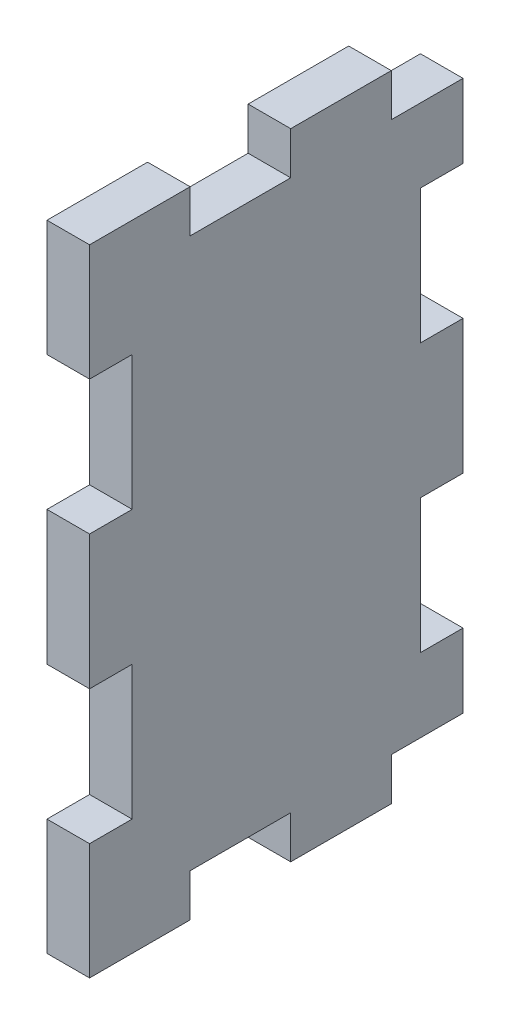
ISO-10303-21;
HEADER;
FILE_DESCRIPTION(('STEP AP214'),'2;1');
FILE_NAME('part.step','',(''),(''),'','','');
FILE_SCHEMA(('AUTOMOTIVE_DESIGN { 1 0 10303 214 1 1 1 1 }'));
ENDSEC;
DATA;
#1=APPLICATION_CONTEXT('core data for automotive mechanical design processes');
#2=APPLICATION_PROTOCOL_DEFINITION('international standard','automotive_design',2000,#1);
#3=PRODUCT_CONTEXT('',#1,'mechanical');
#4=PRODUCT('Part','Part','',(#3));
#5=PRODUCT_RELATED_PRODUCT_CATEGORY('part','',(#4));
#6=PRODUCT_DEFINITION_FORMATION('','',#4);
#7=PRODUCT_DEFINITION_CONTEXT('part definition',#1,'design');
#8=PRODUCT_DEFINITION('design','',#6,#7);
#9=PRODUCT_DEFINITION_SHAPE('','',#8);
#10=(LENGTH_UNIT() NAMED_UNIT(*) SI_UNIT(.MILLI.,.METRE.));
#11=(NAMED_UNIT(*) PLANE_ANGLE_UNIT() SI_UNIT($,.RADIAN.));
#12=(NAMED_UNIT(*) SI_UNIT($,.STERADIAN.) SOLID_ANGLE_UNIT());
#13=UNCERTAINTY_MEASURE_WITH_UNIT(LENGTH_MEASURE(1.E-05),#10,'distance_accuracy_value','');
#14=(GEOMETRIC_REPRESENTATION_CONTEXT(3) GLOBAL_UNCERTAINTY_ASSIGNED_CONTEXT((#13)) GLOBAL_UNIT_ASSIGNED_CONTEXT((#10,
#11,#12)) REPRESENTATION_CONTEXT('',''));
#15=CARTESIAN_POINT('',(0.,0.,0.));
#16=DIRECTION('',(0.,0.,1.));
#17=DIRECTION('',(1.,0.,0.));
#18=AXIS2_PLACEMENT_3D('',#15,#16,#17);
#19=CARTESIAN_POINT('',(3.175,0.,0.));
#20=DIRECTION('',(0.,0.,-1.));
#21=DIRECTION('',(-1.,0.,0.));
#22=AXIS2_PLACEMENT_3D('',#19,#20,#21);
#23=PLANE('',#22);
#24=DIRECTION('',(0.,-1.,0.));
#25=VECTOR('',#24,1.);
#26=CARTESIAN_POINT('',(0.,0.,0.));
#27=LINE('',#26,#25);
#28=CARTESIAN_POINT('',(0.,47.35,0.));
#29=VERTEX_POINT('',#28);
#30=CARTESIAN_POINT('',(0.,38.6749999999999,0.));
#31=VERTEX_POINT('',#30);
#32=EDGE_CURVE('E277',#29,#31,#27,.T.);
#33=ORIENTED_EDGE('',*,*,#32,.T.);
#34=DIRECTION('',(-1.,0.,0.));
#35=VECTOR('',#34,1.);
#36=CARTESIAN_POINT('',(3.175,38.6749999999999,0.));
#37=LINE('',#36,#35);
#38=CARTESIAN_POINT('',(3.175,38.6749999999999,0.));
#39=VERTEX_POINT('',#38);
#40=EDGE_CURVE('E312',#39,#31,#37,.T.);
#41=ORIENTED_EDGE('',*,*,#40,.F.);
#42=DIRECTION('',(0.,-1.,0.));
#43=VECTOR('',#42,1.);
#44=CARTESIAN_POINT('',(3.175,0.,0.));
#45=LINE('',#44,#43);
#46=CARTESIAN_POINT('',(3.175,47.35,0.));
#47=VERTEX_POINT('',#46);
#48=EDGE_CURVE('E291',#47,#39,#45,.T.);
#49=ORIENTED_EDGE('',*,*,#48,.F.);
#50=DIRECTION('',(-1.,0.,0.));
#51=VECTOR('',#50,1.);
#52=CARTESIAN_POINT('',(3.175,47.35,0.));
#53=LINE('',#52,#51);
#54=EDGE_CURVE('E40',#47,#29,#53,.T.);
#55=ORIENTED_EDGE('',*,*,#54,.T.);
#56=EDGE_LOOP('',(#33,#41,#49,#55));
#57=FACE_BOUND('',#56,.T.);
#58=ADVANCED_FACE('F32',(#57),#23,.F.);
#59=CARTESIAN_POINT('',(3.175,0.,0.));
#60=DIRECTION('',(0.,1.,0.));
#61=DIRECTION('',(0.,0.,1.));
#62=AXIS2_PLACEMENT_3D('',#59,#60,#61);
#63=PLANE('',#62);
#64=DIRECTION('',(0.,0.,-1.));
#65=VECTOR('',#64,1.);
#66=CARTESIAN_POINT('',(0.,0.,0.));
#67=LINE('',#66,#65);
#68=CARTESIAN_POINT('',(0.,0.,0.));
#69=VERTEX_POINT('',#68);
#70=CARTESIAN_POINT('',(0.,0.,-7.50000000000044));
#71=VERTEX_POINT('',#70);
#72=EDGE_CURVE('E283',#69,#71,#67,.T.);
#73=ORIENTED_EDGE('',*,*,#72,.T.);
#74=DIRECTION('',(-1.,0.,0.));
#75=VECTOR('',#74,1.);
#76=CARTESIAN_POINT('',(3.175,0.,-7.50000000000044));
#77=LINE('',#76,#75);
#78=CARTESIAN_POINT('',(3.175,0.,-7.50000000000044));
#79=VERTEX_POINT('',#78);
#80=EDGE_CURVE('E432',#79,#71,#77,.T.);
#81=ORIENTED_EDGE('',*,*,#80,.F.);
#82=DIRECTION('',(0.,0.,-1.));
#83=VECTOR('',#82,1.);
#84=CARTESIAN_POINT('',(3.175,0.,0.));
#85=LINE('',#84,#83);
#86=CARTESIAN_POINT('',(3.175,0.,0.));
#87=VERTEX_POINT('',#86);
#88=EDGE_CURVE('E269',#87,#79,#85,.T.);
#89=ORIENTED_EDGE('',*,*,#88,.F.);
#90=DIRECTION('',(-1.,0.,0.));
#91=VECTOR('',#90,1.);
#92=CARTESIAN_POINT('',(3.175,0.,0.));
#93=LINE('',#92,#91);
#94=EDGE_CURVE('E11',#87,#69,#93,.T.);
#95=ORIENTED_EDGE('',*,*,#94,.T.);
#96=EDGE_LOOP('',(#73,#81,#89,#95));
#97=FACE_BOUND('',#96,.T.);
#98=ADVANCED_FACE('F526',(#97),#63,.F.);
#99=CARTESIAN_POINT('',(3.175,47.35,0.));
#100=DIRECTION('',(0.,-1.,0.));
#101=DIRECTION('',(0.,0.,-1.));
#102=AXIS2_PLACEMENT_3D('',#99,#100,#101);
#103=PLANE('',#102);
#104=DIRECTION('',(0.,0.,1.));
#105=VECTOR('',#104,1.);
#106=CARTESIAN_POINT('',(3.175,47.35,0.));
#107=LINE('',#106,#105);
#108=CARTESIAN_POINT('',(3.175,47.35,-7.50000000000044));
#109=VERTEX_POINT('',#108);
#110=EDGE_CURVE('E258',#109,#47,#107,.T.);
#111=ORIENTED_EDGE('',*,*,#110,.F.);
#112=DIRECTION('',(-1.,0.,0.));
#113=VECTOR('',#112,1.);
#114=CARTESIAN_POINT('',(3.175,47.35,-7.50000000000044));
#115=LINE('',#114,#113);
#116=CARTESIAN_POINT('',(0.,47.35,-7.50000000000044));
#117=VERTEX_POINT('',#116);
#118=EDGE_CURVE('E241',#109,#117,#115,.T.);
#119=ORIENTED_EDGE('',*,*,#118,.T.);
#120=DIRECTION('',(0.,0.,1.));
#121=VECTOR('',#120,1.);
#122=CARTESIAN_POINT('',(0.,47.35,0.));
#123=LINE('',#122,#121);
#124=EDGE_CURVE('E286',#117,#29,#123,.T.);
#125=ORIENTED_EDGE('',*,*,#124,.T.);
#126=ORIENTED_EDGE('',*,*,#54,.F.);
#127=EDGE_LOOP('',(#111,#119,#125,#126));
#128=FACE_BOUND('',#127,.T.);
#129=ADVANCED_FACE('F265',(#128),#103,.F.);
#130=CARTESIAN_POINT('',(3.175,47.35,-27.85));
#131=DIRECTION('',(0.,0.,1.));
#132=DIRECTION('',(0.,-1.,0.));
#133=AXIS2_PLACEMENT_3D('',#130,#131,#132);
#134=PLANE('',#133);
#135=DIRECTION('',(0.,1.,0.));
#136=VECTOR('',#135,1.);
#137=CARTESIAN_POINT('',(0.,47.35,-27.85));
#138=LINE('',#137,#136);
#139=CARTESIAN_POINT('',(0.,18.6749999999999,-27.85));
#140=VERTEX_POINT('',#139);
#141=CARTESIAN_POINT('',(0.,28.6749999999999,-27.85));
#142=VERTEX_POINT('',#141);
#143=EDGE_CURVE('E407',#140,#142,#138,.T.);
#144=ORIENTED_EDGE('',*,*,#143,.T.);
#145=DIRECTION('',(-1.,0.,0.));
#146=VECTOR('',#145,1.);
#147=CARTESIAN_POINT('',(3.175,28.6749999999999,-27.85));
#148=LINE('',#147,#146);
#149=CARTESIAN_POINT('',(3.175,28.6749999999999,-27.85));
#150=VERTEX_POINT('',#149);
#151=EDGE_CURVE('E367',#150,#142,#148,.T.);
#152=ORIENTED_EDGE('',*,*,#151,.F.);
#153=DIRECTION('',(0.,1.,0.));
#154=VECTOR('',#153,1.);
#155=CARTESIAN_POINT('',(3.175,47.35,-27.85));
#156=LINE('',#155,#154);
#157=CARTESIAN_POINT('',(3.175,18.6749999999999,-27.85));
#158=VERTEX_POINT('',#157);
#159=EDGE_CURVE('E403',#158,#150,#156,.T.);
#160=ORIENTED_EDGE('',*,*,#159,.F.);
#161=DIRECTION('',(-1.,0.,0.));
#162=VECTOR('',#161,1.);
#163=CARTESIAN_POINT('',(3.175,18.6749999999999,-27.85));
#164=LINE('',#163,#162);
#165=EDGE_CURVE('E343',#158,#140,#164,.T.);
#166=ORIENTED_EDGE('',*,*,#165,.T.);
#167=EDGE_LOOP('',(#144,#152,#160,#166));
#168=FACE_BOUND('',#167,.T.);
#169=ADVANCED_FACE('F563',(#168),#134,.F.);
#170=CARTESIAN_POINT('',(3.175,3.17499999999954,-27.85));
#171=VERTEX_POINT('',#170);
#172=CARTESIAN_POINT('',(3.175,8.67499999999985,-27.85));
#173=VERTEX_POINT('',#172);
#174=EDGE_CURVE('E405',#171,#173,#156,.T.);
#175=ORIENTED_EDGE('',*,*,#174,.F.);
#176=DIRECTION('',(-1.,0.,0.));
#177=VECTOR('',#176,1.);
#178=CARTESIAN_POINT('',(3.175,3.17499999999954,-27.85));
#179=LINE('',#178,#177);
#180=CARTESIAN_POINT('',(0.,3.17499999999955,-27.85));
#181=VERTEX_POINT('',#180);
#182=EDGE_CURVE('E492',#171,#181,#179,.T.);
#183=ORIENTED_EDGE('',*,*,#182,.T.);
#184=CARTESIAN_POINT('',(0.,8.67499999999985,-27.85));
#185=VERTEX_POINT('',#184);
#186=EDGE_CURVE('E404',#181,#185,#138,.T.);
#187=ORIENTED_EDGE('',*,*,#186,.T.);
#188=DIRECTION('',(-1.,0.,0.));
#189=VECTOR('',#188,1.);
#190=CARTESIAN_POINT('',(3.175,8.67499999999985,-27.85));
#191=LINE('',#190,#189);
#192=EDGE_CURVE('E341',#173,#185,#191,.T.);
#193=ORIENTED_EDGE('',*,*,#192,.F.);
#194=EDGE_LOOP('',(#175,#183,#187,#193));
#195=FACE_BOUND('',#194,.T.);
#196=ADVANCED_FACE('F554',(#195),#134,.F.);
#197=CARTESIAN_POINT('',(3.175,28.6749999999999,0.));
#198=VERTEX_POINT('',#197);
#199=CARTESIAN_POINT('',(3.175,18.6749999999999,0.));
#200=VERTEX_POINT('',#199);
#201=EDGE_CURVE('E408',#198,#200,#45,.T.);
#202=ORIENTED_EDGE('',*,*,#201,.F.);
#203=DIRECTION('',(-1.,0.,0.));
#204=VECTOR('',#203,1.);
#205=CARTESIAN_POINT('',(3.175,28.6749999999999,0.));
#206=LINE('',#205,#204);
#207=CARTESIAN_POINT('',(0.,28.6749999999999,0.));
#208=VERTEX_POINT('',#207);
#209=EDGE_CURVE('E314',#198,#208,#206,.T.);
#210=ORIENTED_EDGE('',*,*,#209,.T.);
#211=CARTESIAN_POINT('',(0.,18.6749999999999,0.));
#212=VERTEX_POINT('',#211);
#213=EDGE_CURVE('E281',#208,#212,#27,.T.);
#214=ORIENTED_EDGE('',*,*,#213,.T.);
#215=DIRECTION('',(-1.,0.,0.));
#216=VECTOR('',#215,1.);
#217=CARTESIAN_POINT('',(3.175,18.6749999999999,0.));
#218=LINE('',#217,#216);
#219=EDGE_CURVE('E392',#200,#212,#218,.T.);
#220=ORIENTED_EDGE('',*,*,#219,.F.);
#221=EDGE_LOOP('',(#202,#210,#214,#220));
#222=FACE_BOUND('',#221,.T.);
#223=ADVANCED_FACE('F508',(#222),#23,.F.);
#224=CARTESIAN_POINT('',(3.175,8.67499999999985,0.));
#225=VERTEX_POINT('',#224);
#226=EDGE_CURVE('E409',#225,#87,#45,.T.);
#227=ORIENTED_EDGE('',*,*,#226,.F.);
#228=DIRECTION('',(-1.,0.,0.));
#229=VECTOR('',#228,1.);
#230=CARTESIAN_POINT('',(3.175,8.67499999999985,0.));
#231=LINE('',#230,#229);
#232=CARTESIAN_POINT('',(0.,8.67499999999985,0.));
#233=VERTEX_POINT('',#232);
#234=EDGE_CURVE('E395',#225,#233,#231,.T.);
#235=ORIENTED_EDGE('',*,*,#234,.T.);
#236=EDGE_CURVE('E282',#233,#69,#27,.T.);
#237=ORIENTED_EDGE('',*,*,#236,.T.);
#238=ORIENTED_EDGE('',*,*,#94,.F.);
#239=EDGE_LOOP('',(#227,#235,#237,#238));
#240=FACE_BOUND('',#239,.T.);
#241=ADVANCED_FACE('F34',(#240),#23,.F.);
#242=CARTESIAN_POINT('',(0.,0.,-15.));
#243=VERTEX_POINT('',#242);
#244=CARTESIAN_POINT('',(0.,0.,-22.5000000000004));
#245=VERTEX_POINT('',#244);
#246=EDGE_CURVE('E280',#243,#245,#67,.T.);
#247=ORIENTED_EDGE('',*,*,#246,.T.);
#248=DIRECTION('',(-1.,0.,0.));
#249=VECTOR('',#248,1.);
#250=CARTESIAN_POINT('',(3.175,0.,-22.5000000000004));
#251=LINE('',#250,#249);
#252=CARTESIAN_POINT('',(3.175,0.,-22.5000000000004));
#253=VERTEX_POINT('',#252);
#254=EDGE_CURVE('E472',#253,#245,#251,.T.);
#255=ORIENTED_EDGE('',*,*,#254,.F.);
#256=CARTESIAN_POINT('',(3.175,0.,-15.));
#257=VERTEX_POINT('',#256);
#258=EDGE_CURVE('E273',#257,#253,#85,.T.);
#259=ORIENTED_EDGE('',*,*,#258,.F.);
#260=DIRECTION('',(-1.,0.,0.));
#261=VECTOR('',#260,1.);
#262=CARTESIAN_POINT('',(3.175,0.,-15.));
#263=LINE('',#262,#261);
#264=EDGE_CURVE('E458',#257,#243,#263,.T.);
#265=ORIENTED_EDGE('',*,*,#264,.T.);
#266=EDGE_LOOP('',(#247,#255,#259,#265));
#267=FACE_BOUND('',#266,.T.);
#268=ADVANCED_FACE('F541',(#267),#63,.F.);
#269=CARTESIAN_POINT('',(3.175,47.35,-22.5000000000004));
#270=VERTEX_POINT('',#269);
#271=CARTESIAN_POINT('',(3.175,47.35,-15.));
#272=VERTEX_POINT('',#271);
#273=EDGE_CURVE('E268',#270,#272,#107,.T.);
#274=ORIENTED_EDGE('',*,*,#273,.F.);
#275=DIRECTION('',(-1.,0.,0.));
#276=VECTOR('',#275,1.);
#277=CARTESIAN_POINT('',(3.175,47.35,-22.5000000000004));
#278=LINE('',#277,#276);
#279=CARTESIAN_POINT('',(0.,47.35,-22.5000000000004));
#280=VERTEX_POINT('',#279);
#281=EDGE_CURVE('E420',#270,#280,#278,.T.);
#282=ORIENTED_EDGE('',*,*,#281,.T.);
#283=CARTESIAN_POINT('',(0.,47.35,-15.));
#284=VERTEX_POINT('',#283);
#285=EDGE_CURVE('E287',#280,#284,#123,.T.);
#286=ORIENTED_EDGE('',*,*,#285,.T.);
#287=DIRECTION('',(-1.,0.,0.));
#288=VECTOR('',#287,1.);
#289=CARTESIAN_POINT('',(3.175,47.35,-15.));
#290=LINE('',#289,#288);
#291=EDGE_CURVE('E251',#272,#284,#290,.T.);
#292=ORIENTED_EDGE('',*,*,#291,.F.);
#293=EDGE_LOOP('',(#274,#282,#286,#292));
#294=FACE_BOUND('',#293,.T.);
#295=ADVANCED_FACE('F419',(#294),#103,.F.);
#296=CARTESIAN_POINT('',(3.175,0.,0.));
#297=DIRECTION('',(-1.,0.,0.));
#298=DIRECTION('',(0.,0.,1.));
#299=AXIS2_PLACEMENT_3D('',#296,#297,#298);
#300=PLANE('',#299);
#301=ORIENTED_EDGE('',*,*,#258,.T.);
#302=DIRECTION('',(0.,1.,0.));
#303=VECTOR('',#302,1.);
#304=CARTESIAN_POINT('',(3.175,3.17499999999955,-22.5000000000004));
#305=LINE('',#304,#303);
#306=CARTESIAN_POINT('',(3.175,3.17499999999955,-22.5000000000004));
#307=VERTEX_POINT('',#306);
#308=EDGE_CURVE('E479',#253,#307,#305,.T.);
#309=ORIENTED_EDGE('',*,*,#308,.T.);
#310=DIRECTION('',(0.,0.,-1.));
#311=VECTOR('',#310,1.);
#312=CARTESIAN_POINT('',(3.175,3.17499999999955,-22.5000000000004));
#313=LINE('',#312,#311);
#314=EDGE_CURVE('E482',#307,#171,#313,.T.);
#315=ORIENTED_EDGE('',*,*,#314,.T.);
#316=ORIENTED_EDGE('',*,*,#174,.T.);
#317=DIRECTION('',(0.,0.,1.));
#318=VECTOR('',#317,1.);
#319=CARTESIAN_POINT('',(3.175,8.67499999999985,-24.6750000000001));
#320=LINE('',#319,#318);
#321=CARTESIAN_POINT('',(3.175,8.67499999999985,-24.6750000000001));
#322=VERTEX_POINT('',#321);
#323=EDGE_CURVE('E327',#173,#322,#320,.T.);
#324=ORIENTED_EDGE('',*,*,#323,.T.);
#325=DIRECTION('',(0.,1.,0.));
#326=VECTOR('',#325,1.);
#327=CARTESIAN_POINT('',(3.175,8.67499999999985,-24.6750000000001));
#328=LINE('',#327,#326);
#329=CARTESIAN_POINT('',(3.175,18.6749999999999,-24.6750000000001));
#330=VERTEX_POINT('',#329);
#331=EDGE_CURVE('E320',#322,#330,#328,.T.);
#332=ORIENTED_EDGE('',*,*,#331,.T.);
#333=DIRECTION('',(0.,0.,-1.));
#334=VECTOR('',#333,1.);
#335=CARTESIAN_POINT('',(3.175,18.6749999999999,-24.6750000000001));
#336=LINE('',#335,#334);
#337=EDGE_CURVE('E323',#330,#158,#336,.T.);
#338=ORIENTED_EDGE('',*,*,#337,.T.);
#339=ORIENTED_EDGE('',*,*,#159,.T.);
#340=DIRECTION('',(0.,0.,1.));
#341=VECTOR('',#340,1.);
#342=CARTESIAN_POINT('',(3.175,28.6749999999999,-24.6750000000002));
#343=LINE('',#342,#341);
#344=CARTESIAN_POINT('',(3.175,28.6749999999999,-24.6750000000002));
#345=VERTEX_POINT('',#344);
#346=EDGE_CURVE('E354',#150,#345,#343,.T.);
#347=ORIENTED_EDGE('',*,*,#346,.T.);
#348=DIRECTION('',(0.,1.,0.));
#349=VECTOR('',#348,1.);
#350=CARTESIAN_POINT('',(3.175,28.6749999999999,-24.6750000000002));
#351=LINE('',#350,#349);
#352=CARTESIAN_POINT('',(3.175,38.6749999999999,-24.6750000000002));
#353=VERTEX_POINT('',#352);
#354=EDGE_CURVE('E347',#345,#353,#351,.T.);
#355=ORIENTED_EDGE('',*,*,#354,.T.);
#356=DIRECTION('',(0.,0.,-1.));
#357=VECTOR('',#356,1.);
#358=CARTESIAN_POINT('',(3.175,38.6749999999999,-24.6750000000002));
#359=LINE('',#358,#357);
#360=CARTESIAN_POINT('',(3.175,38.6749999999999,-27.85));
#361=VERTEX_POINT('',#360);
#362=EDGE_CURVE('E350',#353,#361,#359,.T.);
#363=ORIENTED_EDGE('',*,*,#362,.T.);
#364=CARTESIAN_POINT('',(3.175,44.1750000000005,-27.85));
#365=VERTEX_POINT('',#364);
#366=EDGE_CURVE('E400',#361,#365,#156,.T.);
#367=ORIENTED_EDGE('',*,*,#366,.T.);
#368=DIRECTION('',(0.,0.,1.));
#369=VECTOR('',#368,1.);
#370=CARTESIAN_POINT('',(3.175,44.1750000000005,-22.5000000000004));
#371=LINE('',#370,#369);
#372=CARTESIAN_POINT('',(3.175,44.1750000000005,-22.5000000000004));
#373=VERTEX_POINT('',#372);
#374=EDGE_CURVE('E467',#365,#373,#371,.T.);
#375=ORIENTED_EDGE('',*,*,#374,.T.);
#376=DIRECTION('',(0.,1.,0.));
#377=VECTOR('',#376,1.);
#378=CARTESIAN_POINT('',(3.175,44.1750000000005,-22.5000000000004));
#379=LINE('',#378,#377);
#380=EDGE_CURVE('E464',#373,#270,#379,.T.);
#381=ORIENTED_EDGE('',*,*,#380,.T.);
#382=ORIENTED_EDGE('',*,*,#273,.T.);
#383=DIRECTION('',(0.,-1.,0.));
#384=VECTOR('',#383,1.);
#385=CARTESIAN_POINT('',(3.175,44.1750000000005,-15.));
#386=LINE('',#385,#384);
#387=CARTESIAN_POINT('',(3.175,44.1750000000005,-15.));
#388=VERTEX_POINT('',#387);
#389=EDGE_CURVE('E262',#272,#388,#386,.T.);
#390=ORIENTED_EDGE('',*,*,#389,.T.);
#391=DIRECTION('',(0.,0.,1.));
#392=VECTOR('',#391,1.);
#393=CARTESIAN_POINT('',(3.175,44.1750000000005,-7.50000000000044));
#394=LINE('',#393,#392);
#395=CARTESIAN_POINT('',(3.175,44.1750000000005,-7.50000000000044));
#396=VERTEX_POINT('',#395);
#397=EDGE_CURVE('E252',#388,#396,#394,.T.);
#398=ORIENTED_EDGE('',*,*,#397,.T.);
#399=DIRECTION('',(0.,1.,0.));
#400=VECTOR('',#399,1.);
#401=CARTESIAN_POINT('',(3.175,44.1750000000005,-7.50000000000044));
#402=LINE('',#401,#400);
#403=EDGE_CURVE('E244',#396,#109,#402,.T.);
#404=ORIENTED_EDGE('',*,*,#403,.T.);
#405=ORIENTED_EDGE('',*,*,#110,.T.);
#406=ORIENTED_EDGE('',*,*,#48,.T.);
#407=DIRECTION('',(0.,0.,-1.));
#408=VECTOR('',#407,1.);
#409=CARTESIAN_POINT('',(3.175,38.6749999999999,-3.17500000000018));
#410=LINE('',#409,#408);
#411=CARTESIAN_POINT('',(3.175,38.6749999999999,-3.17500000000018));
#412=VERTEX_POINT('',#411);
#413=EDGE_CURVE('E319',#39,#412,#410,.T.);
#414=ORIENTED_EDGE('',*,*,#413,.T.);
#415=DIRECTION('',(0.,-1.,0.));
#416=VECTOR('',#415,1.);
#417=CARTESIAN_POINT('',(3.175,28.6749999999999,-3.17500000000018));
#418=LINE('',#417,#416);
#419=CARTESIAN_POINT('',(3.175,28.6749999999999,-3.17500000000018));
#420=VERTEX_POINT('',#419);
#421=EDGE_CURVE('E300',#412,#420,#418,.T.);
#422=ORIENTED_EDGE('',*,*,#421,.T.);
#423=DIRECTION('',(0.,0.,1.));
#424=VECTOR('',#423,1.);
#425=CARTESIAN_POINT('',(3.175,28.6749999999999,-3.17500000000018));
#426=LINE('',#425,#424);
#427=EDGE_CURVE('E304',#420,#198,#426,.T.);
#428=ORIENTED_EDGE('',*,*,#427,.T.);
#429=ORIENTED_EDGE('',*,*,#201,.T.);
#430=DIRECTION('',(0.,0.,-1.));
#431=VECTOR('',#430,1.);
#432=CARTESIAN_POINT('',(3.175,18.6749999999999,-3.17500000000011));
#433=LINE('',#432,#431);
#434=CARTESIAN_POINT('',(3.175,18.6749999999999,-3.17500000000011));
#435=VERTEX_POINT('',#434);
#436=EDGE_CURVE('E380',#200,#435,#433,.T.);
#437=ORIENTED_EDGE('',*,*,#436,.T.);
#438=DIRECTION('',(0.,-1.,0.));
#439=VECTOR('',#438,1.);
#440=CARTESIAN_POINT('',(3.175,8.67499999999985,-3.17500000000011));
#441=LINE('',#440,#439);
#442=CARTESIAN_POINT('',(3.175,8.67499999999985,-3.17500000000011));
#443=VERTEX_POINT('',#442);
#444=EDGE_CURVE('E373',#435,#443,#441,.T.);
#445=ORIENTED_EDGE('',*,*,#444,.T.);
#446=DIRECTION('',(0.,0.,1.));
#447=VECTOR('',#446,1.);
#448=CARTESIAN_POINT('',(3.175,8.67499999999985,-3.17500000000011));
#449=LINE('',#448,#447);
#450=EDGE_CURVE('E376',#443,#225,#449,.T.);
#451=ORIENTED_EDGE('',*,*,#450,.T.);
#452=ORIENTED_EDGE('',*,*,#226,.T.);
#453=ORIENTED_EDGE('',*,*,#88,.T.);
#454=DIRECTION('',(0.,1.,1.3987061727563E-13));
#455=VECTOR('',#454,1.);
#456=CARTESIAN_POINT('',(3.175,3.17499999999955,-7.5));
#457=LINE('',#456,#455);
#458=CARTESIAN_POINT('',(3.175,3.17499999999955,-7.5));
#459=VERTEX_POINT('',#458);
#460=EDGE_CURVE('E440',#79,#459,#457,.T.);
#461=ORIENTED_EDGE('',*,*,#460,.T.);
#462=DIRECTION('',(0.,0.,-1.));
#463=VECTOR('',#462,1.);
#464=CARTESIAN_POINT('',(3.175,3.17499999999955,-7.5));
#465=LINE('',#464,#463);
#466=CARTESIAN_POINT('',(3.175,3.17499999999955,-15.));
#467=VERTEX_POINT('',#466);
#468=EDGE_CURVE('E443',#459,#467,#465,.T.);
#469=ORIENTED_EDGE('',*,*,#468,.T.);
#470=DIRECTION('',(0.,-1.,0.));
#471=VECTOR('',#470,1.);
#472=CARTESIAN_POINT('',(3.175,3.17499999999955,-15.));
#473=LINE('',#472,#471);
#474=EDGE_CURVE('E447',#467,#257,#473,.T.);
#475=ORIENTED_EDGE('',*,*,#474,.T.);
#476=EDGE_LOOP('',(#301,#309,#315,#316,#324,#332,#338,#339,#347,#355,#363,#367,#375,#381,#382,
#390,#398,#404,#405,#406,#414,#422,#428,#429,#437,#445,#451,#452,#453,#461,#469,#475));
#477=FACE_BOUND('',#476,.T.);
#478=ADVANCED_FACE('F256',(#477),#300,.F.);
#479=CARTESIAN_POINT('',(0.,0.,0.));
#480=DIRECTION('',(-1.,0.,0.));
#481=DIRECTION('',(0.,0.,1.));
#482=AXIS2_PLACEMENT_3D('',#479,#480,#481);
#483=PLANE('',#482);
#484=DIRECTION('',(0.,1.,0.));
#485=VECTOR('',#484,1.);
#486=CARTESIAN_POINT('',(0.,3.17499999999955,-22.5000000000004));
#487=LINE('',#486,#485);
#488=CARTESIAN_POINT('',(0.,3.17499999999955,-22.5000000000004));
#489=VERTEX_POINT('',#488);
#490=EDGE_CURVE('E487',#245,#489,#487,.T.);
#491=ORIENTED_EDGE('',*,*,#490,.F.);
#492=ORIENTED_EDGE('',*,*,#246,.F.);
#493=DIRECTION('',(0.,-1.,0.));
#494=VECTOR('',#493,1.);
#495=CARTESIAN_POINT('',(0.,3.17499999999955,-15.));
#496=LINE('',#495,#494);
#497=CARTESIAN_POINT('',(0.,3.17499999999955,-15.));
#498=VERTEX_POINT('',#497);
#499=EDGE_CURVE('E444',#498,#243,#496,.T.);
#500=ORIENTED_EDGE('',*,*,#499,.F.);
#501=DIRECTION('',(0.,0.,-1.));
#502=VECTOR('',#501,1.);
#503=CARTESIAN_POINT('',(0.,3.17499999999955,-7.5));
#504=LINE('',#503,#502);
#505=CARTESIAN_POINT('',(0.,3.17499999999955,-7.5));
#506=VERTEX_POINT('',#505);
#507=EDGE_CURVE('E452',#506,#498,#504,.T.);
#508=ORIENTED_EDGE('',*,*,#507,.F.);
#509=DIRECTION('',(0.,1.,1.3987061727563E-13));
#510=VECTOR('',#509,1.);
#511=CARTESIAN_POINT('',(0.,3.17499999999955,-7.5));
#512=LINE('',#511,#510);
#513=EDGE_CURVE('E47',#71,#506,#512,.T.);
#514=ORIENTED_EDGE('',*,*,#513,.F.);
#515=ORIENTED_EDGE('',*,*,#72,.F.);
#516=ORIENTED_EDGE('',*,*,#236,.F.);
#517=DIRECTION('',(0.,0.,1.));
#518=VECTOR('',#517,1.);
#519=CARTESIAN_POINT('',(0.,8.67499999999985,-3.17500000000011));
#520=LINE('',#519,#518);
#521=CARTESIAN_POINT('',(0.,8.67499999999985,-3.17500000000011));
#522=VERTEX_POINT('',#521);
#523=EDGE_CURVE('E385',#522,#233,#520,.T.);
#524=ORIENTED_EDGE('',*,*,#523,.F.);
#525=DIRECTION('',(0.,-1.,0.));
#526=VECTOR('',#525,1.);
#527=CARTESIAN_POINT('',(0.,8.67499999999985,-3.17500000000011));
#528=LINE('',#527,#526);
#529=CARTESIAN_POINT('',(0.,18.6749999999999,-3.17500000000011));
#530=VERTEX_POINT('',#529);
#531=EDGE_CURVE('E311',#530,#522,#528,.T.);
#532=ORIENTED_EDGE('',*,*,#531,.F.);
#533=DIRECTION('',(0.,0.,-1.));
#534=VECTOR('',#533,1.);
#535=CARTESIAN_POINT('',(0.,18.6749999999999,-3.17500000000011));
#536=LINE('',#535,#534);
#537=EDGE_CURVE('E377',#212,#530,#536,.T.);
#538=ORIENTED_EDGE('',*,*,#537,.F.);
#539=ORIENTED_EDGE('',*,*,#213,.F.);
#540=DIRECTION('',(0.,0.,1.));
#541=VECTOR('',#540,1.);
#542=CARTESIAN_POINT('',(0.,28.6749999999999,-3.17500000000018));
#543=LINE('',#542,#541);
#544=CARTESIAN_POINT('',(0.,28.6749999999999,-3.17500000000018));
#545=VERTEX_POINT('',#544);
#546=EDGE_CURVE('E301',#545,#208,#543,.T.);
#547=ORIENTED_EDGE('',*,*,#546,.F.);
#548=DIRECTION('',(0.,-1.,0.));
#549=VECTOR('',#548,1.);
#550=CARTESIAN_POINT('',(0.,28.6749999999999,-3.17500000000018));
#551=LINE('',#550,#549);
#552=CARTESIAN_POINT('',(0.,38.6749999999999,-3.17500000000018));
#553=VERTEX_POINT('',#552);
#554=EDGE_CURVE('E55',#553,#545,#551,.T.);
#555=ORIENTED_EDGE('',*,*,#554,.F.);
#556=DIRECTION('',(0.,0.,-1.));
#557=VECTOR('',#556,1.);
#558=CARTESIAN_POINT('',(0.,38.6749999999999,-3.17500000000018));
#559=LINE('',#558,#557);
#560=EDGE_CURVE('E297',#31,#553,#559,.T.);
#561=ORIENTED_EDGE('',*,*,#560,.F.);
#562=ORIENTED_EDGE('',*,*,#32,.F.);
#563=ORIENTED_EDGE('',*,*,#124,.F.);
#564=DIRECTION('',(0.,1.,0.));
#565=VECTOR('',#564,1.);
#566=CARTESIAN_POINT('',(0.,44.1750000000005,-7.50000000000044));
#567=LINE('',#566,#565);
#568=CARTESIAN_POINT('',(0.,44.1750000000005,-7.50000000000044));
#569=VERTEX_POINT('',#568);
#570=EDGE_CURVE('E247',#569,#117,#567,.T.);
#571=ORIENTED_EDGE('',*,*,#570,.F.);
#572=DIRECTION('',(0.,0.,1.));
#573=VECTOR('',#572,1.);
#574=CARTESIAN_POINT('',(0.,44.1750000000005,-7.50000000000044));
#575=LINE('',#574,#573);
#576=CARTESIAN_POINT('',(0.,44.1750000000005,-15.));
#577=VERTEX_POINT('',#576);
#578=EDGE_CURVE('E263',#577,#569,#575,.T.);
#579=ORIENTED_EDGE('',*,*,#578,.F.);
#580=DIRECTION('',(0.,-1.,0.));
#581=VECTOR('',#580,1.);
#582=CARTESIAN_POINT('',(0.,44.1750000000005,-15.));
#583=LINE('',#582,#581);
#584=EDGE_CURVE('E427',#284,#577,#583,.T.);
#585=ORIENTED_EDGE('',*,*,#584,.F.);
#586=ORIENTED_EDGE('',*,*,#285,.F.);
#587=DIRECTION('',(0.,1.,0.));
#588=VECTOR('',#587,1.);
#589=CARTESIAN_POINT('',(0.,44.1750000000005,-22.5000000000004));
#590=LINE('',#589,#588);
#591=CARTESIAN_POINT('',(0.,44.1750000000005,-22.5000000000004));
#592=VERTEX_POINT('',#591);
#593=EDGE_CURVE('E424',#592,#280,#590,.T.);
#594=ORIENTED_EDGE('',*,*,#593,.F.);
#595=DIRECTION('',(0.,0.,1.));
#596=VECTOR('',#595,1.);
#597=CARTESIAN_POINT('',(0.,44.1750000000005,-22.5000000000004));
#598=LINE('',#597,#596);
#599=CARTESIAN_POINT('',(0.,44.1750000000005,-27.85));
#600=VERTEX_POINT('',#599);
#601=EDGE_CURVE('E468',#600,#592,#598,.T.);
#602=ORIENTED_EDGE('',*,*,#601,.F.);
#603=CARTESIAN_POINT('',(0.,38.6749999999999,-27.85));
#604=VERTEX_POINT('',#603);
#605=EDGE_CURVE('E391',#604,#600,#138,.T.);
#606=ORIENTED_EDGE('',*,*,#605,.F.);
#607=DIRECTION('',(0.,0.,-1.));
#608=VECTOR('',#607,1.);
#609=CARTESIAN_POINT('',(0.,38.6749999999999,-24.6750000000002));
#610=LINE('',#609,#608);
#611=CARTESIAN_POINT('',(0.,38.6749999999999,-24.6750000000002));
#612=VERTEX_POINT('',#611);
#613=EDGE_CURVE('E361',#612,#604,#610,.T.);
#614=ORIENTED_EDGE('',*,*,#613,.F.);
#615=DIRECTION('',(0.,1.,0.));
#616=VECTOR('',#615,1.);
#617=CARTESIAN_POINT('',(0.,28.6749999999999,-24.6750000000002));
#618=LINE('',#617,#616);
#619=CARTESIAN_POINT('',(0.,28.6749999999999,-24.6750000000002));
#620=VERTEX_POINT('',#619);
#621=EDGE_CURVE('E358',#620,#612,#618,.T.);
#622=ORIENTED_EDGE('',*,*,#621,.F.);
#623=DIRECTION('',(0.,0.,1.));
#624=VECTOR('',#623,1.);
#625=CARTESIAN_POINT('',(0.,28.6749999999999,-24.6750000000002));
#626=LINE('',#625,#624);
#627=EDGE_CURVE('E351',#142,#620,#626,.T.);
#628=ORIENTED_EDGE('',*,*,#627,.F.);
#629=ORIENTED_EDGE('',*,*,#143,.F.);
#630=DIRECTION('',(0.,0.,-1.));
#631=VECTOR('',#630,1.);
#632=CARTESIAN_POINT('',(0.,18.6749999999999,-24.6750000000001));
#633=LINE('',#632,#631);
#634=CARTESIAN_POINT('',(0.,18.6749999999999,-24.6750000000001));
#635=VERTEX_POINT('',#634);
#636=EDGE_CURVE('E334',#635,#140,#633,.T.);
#637=ORIENTED_EDGE('',*,*,#636,.F.);
#638=DIRECTION('',(0.,1.,0.));
#639=VECTOR('',#638,1.);
#640=CARTESIAN_POINT('',(0.,8.67499999999985,-24.6750000000001));
#641=LINE('',#640,#639);
#642=CARTESIAN_POINT('',(0.,8.67499999999985,-24.6750000000001));
#643=VERTEX_POINT('',#642);
#644=EDGE_CURVE('E331',#643,#635,#641,.T.);
#645=ORIENTED_EDGE('',*,*,#644,.F.);
#646=DIRECTION('',(0.,0.,1.));
#647=VECTOR('',#646,1.);
#648=CARTESIAN_POINT('',(0.,8.67499999999985,-24.6750000000001));
#649=LINE('',#648,#647);
#650=EDGE_CURVE('E324',#185,#643,#649,.T.);
#651=ORIENTED_EDGE('',*,*,#650,.F.);
#652=ORIENTED_EDGE('',*,*,#186,.F.);
#653=DIRECTION('',(0.,0.,-1.));
#654=VECTOR('',#653,1.);
#655=CARTESIAN_POINT('',(0.,3.17499999999955,-22.5000000000004));
#656=LINE('',#655,#654);
#657=EDGE_CURVE('E483',#489,#181,#656,.T.);
#658=ORIENTED_EDGE('',*,*,#657,.F.);
#659=EDGE_LOOP('',(#491,#492,#500,#508,#514,#515,#516,#524,#532,#538,#539,#547,#555,#561,#562,
#563,#571,#579,#585,#586,#594,#602,#606,#614,#622,#628,#629,#637,#645,#651,#652,#658));
#660=FACE_BOUND('',#659,.T.);
#661=ADVANCED_FACE('F295',(#660),#483,.T.);
#662=ORIENTED_EDGE('',*,*,#605,.T.);
#663=DIRECTION('',(-1.,0.,0.));
#664=VECTOR('',#663,1.);
#665=CARTESIAN_POINT('',(3.175,44.1750000000005,-27.85));
#666=LINE('',#665,#664);
#667=EDGE_CURVE('E476',#365,#600,#666,.T.);
#668=ORIENTED_EDGE('',*,*,#667,.F.);
#669=ORIENTED_EDGE('',*,*,#366,.F.);
#670=DIRECTION('',(-1.,0.,0.));
#671=VECTOR('',#670,1.);
#672=CARTESIAN_POINT('',(3.175,38.6749999999999,-27.85));
#673=LINE('',#672,#671);
#674=EDGE_CURVE('E369',#361,#604,#673,.T.);
#675=ORIENTED_EDGE('',*,*,#674,.T.);
#676=EDGE_LOOP('',(#662,#668,#669,#675));
#677=FACE_BOUND('',#676,.T.);
#678=ADVANCED_FACE('F580',(#677),#134,.F.);
#679=CARTESIAN_POINT('',(3.175,8.67499999999985,-3.17500000000011));
#680=DIRECTION('',(0.,0.,-1.));
#681=DIRECTION('',(-1.,0.,0.));
#682=AXIS2_PLACEMENT_3D('',#679,#680,#681);
#683=PLANE('',#682);
#684=ORIENTED_EDGE('',*,*,#531,.T.);
#685=DIRECTION('',(-1.,0.,0.));
#686=VECTOR('',#685,1.);
#687=CARTESIAN_POINT('',(3.175,8.67499999999985,-3.17500000000011));
#688=LINE('',#687,#686);
#689=EDGE_CURVE('E383',#443,#522,#688,.T.);
#690=ORIENTED_EDGE('',*,*,#689,.F.);
#691=ORIENTED_EDGE('',*,*,#444,.F.);
#692=DIRECTION('',(-1.,0.,0.));
#693=VECTOR('',#692,1.);
#694=CARTESIAN_POINT('',(3.175,18.6749999999999,-3.17500000000011));
#695=LINE('',#694,#693);
#696=EDGE_CURVE('E389',#435,#530,#695,.T.);
#697=ORIENTED_EDGE('',*,*,#696,.T.);
#698=EDGE_LOOP('',(#684,#690,#691,#697));
#699=FACE_BOUND('',#698,.T.);
#700=ADVANCED_FACE('F517',(#699),#683,.F.);
#701=CARTESIAN_POINT('',(3.175,18.6749999999999,-3.17500000000011));
#702=DIRECTION('',(0.,1.,0.));
#703=DIRECTION('',(0.,0.,1.));
#704=AXIS2_PLACEMENT_3D('',#701,#702,#703);
#705=PLANE('',#704);
#706=ORIENTED_EDGE('',*,*,#537,.T.);
#707=ORIENTED_EDGE('',*,*,#696,.F.);
#708=ORIENTED_EDGE('',*,*,#436,.F.);
#709=ORIENTED_EDGE('',*,*,#219,.T.);
#710=EDGE_LOOP('',(#706,#707,#708,#709));
#711=FACE_BOUND('',#710,.T.);
#712=ADVANCED_FACE('F512',(#711),#705,.F.);
#713=CARTESIAN_POINT('',(3.175,8.67499999999985,-3.17500000000011));
#714=DIRECTION('',(0.,-1.,0.));
#715=DIRECTION('',(0.,0.,-1.));
#716=AXIS2_PLACEMENT_3D('',#713,#714,#715);
#717=PLANE('',#716);
#718=ORIENTED_EDGE('',*,*,#523,.T.);
#719=ORIENTED_EDGE('',*,*,#234,.F.);
#720=ORIENTED_EDGE('',*,*,#450,.F.);
#721=ORIENTED_EDGE('',*,*,#689,.T.);
#722=EDGE_LOOP('',(#718,#719,#720,#721));
#723=FACE_BOUND('',#722,.T.);
#724=ADVANCED_FACE('F521',(#723),#717,.F.);
#725=CARTESIAN_POINT('',(3.175,8.67499999999985,-24.6750000000001));
#726=DIRECTION('',(0.,0.,1.));
#727=DIRECTION('',(1.,0.,0.));
#728=AXIS2_PLACEMENT_3D('',#725,#726,#727);
#729=PLANE('',#728);
#730=ORIENTED_EDGE('',*,*,#644,.T.);
#731=DIRECTION('',(-1.,0.,0.));
#732=VECTOR('',#731,1.);
#733=CARTESIAN_POINT('',(3.175,18.6749999999999,-24.6750000000001));
#734=LINE('',#733,#732);
#735=EDGE_CURVE('E330',#330,#635,#734,.T.);
#736=ORIENTED_EDGE('',*,*,#735,.F.);
#737=ORIENTED_EDGE('',*,*,#331,.F.);
#738=DIRECTION('',(-1.,0.,0.));
#739=VECTOR('',#738,1.);
#740=CARTESIAN_POINT('',(3.175,8.67499999999985,-24.6750000000001));
#741=LINE('',#740,#739);
#742=EDGE_CURVE('E339',#322,#643,#741,.T.);
#743=ORIENTED_EDGE('',*,*,#742,.T.);
#744=EDGE_LOOP('',(#730,#736,#737,#743));
#745=FACE_BOUND('',#744,.T.);
#746=ADVANCED_FACE('F620',(#745),#729,.F.);
#747=CARTESIAN_POINT('',(3.175,8.67499999999985,-24.6750000000001));
#748=DIRECTION('',(0.,-1.,0.));
#749=DIRECTION('',(0.,0.,-1.));
#750=AXIS2_PLACEMENT_3D('',#747,#748,#749);
#751=PLANE('',#750);
#752=ORIENTED_EDGE('',*,*,#650,.T.);
#753=ORIENTED_EDGE('',*,*,#742,.F.);
#754=ORIENTED_EDGE('',*,*,#323,.F.);
#755=ORIENTED_EDGE('',*,*,#192,.T.);
#756=EDGE_LOOP('',(#752,#753,#754,#755));
#757=FACE_BOUND('',#756,.T.);
#758=ADVANCED_FACE('F630',(#757),#751,.F.);
#759=CARTESIAN_POINT('',(3.175,18.6749999999999,-24.6750000000001));
#760=DIRECTION('',(0.,1.,0.));
#761=DIRECTION('',(0.,0.,1.));
#762=AXIS2_PLACEMENT_3D('',#759,#760,#761);
#763=PLANE('',#762);
#764=ORIENTED_EDGE('',*,*,#636,.T.);
#765=ORIENTED_EDGE('',*,*,#165,.F.);
#766=ORIENTED_EDGE('',*,*,#337,.F.);
#767=ORIENTED_EDGE('',*,*,#735,.T.);
#768=EDGE_LOOP('',(#764,#765,#766,#767));
#769=FACE_BOUND('',#768,.T.);
#770=ADVANCED_FACE('F624',(#769),#763,.F.);
#771=CARTESIAN_POINT('',(3.175,28.6749999999999,-24.6750000000002));
#772=DIRECTION('',(0.,0.,1.));
#773=DIRECTION('',(1.,0.,0.));
#774=AXIS2_PLACEMENT_3D('',#771,#772,#773);
#775=PLANE('',#774);
#776=ORIENTED_EDGE('',*,*,#621,.T.);
#777=DIRECTION('',(-1.,0.,0.));
#778=VECTOR('',#777,1.);
#779=CARTESIAN_POINT('',(3.175,38.6749999999999,-24.6750000000002));
#780=LINE('',#779,#778);
#781=EDGE_CURVE('E357',#353,#612,#780,.T.);
#782=ORIENTED_EDGE('',*,*,#781,.F.);
#783=ORIENTED_EDGE('',*,*,#354,.F.);
#784=DIRECTION('',(-1.,0.,0.));
#785=VECTOR('',#784,1.);
#786=CARTESIAN_POINT('',(3.175,28.6749999999999,-24.6750000000002));
#787=LINE('',#786,#785);
#788=EDGE_CURVE('E335',#345,#620,#787,.T.);
#789=ORIENTED_EDGE('',*,*,#788,.T.);
#790=EDGE_LOOP('',(#776,#782,#783,#789));
#791=FACE_BOUND('',#790,.T.);
#792=ADVANCED_FACE('F573',(#791),#775,.F.);
#793=CARTESIAN_POINT('',(3.175,28.6749999999999,-24.6750000000002));
#794=DIRECTION('',(0.,-1.,0.));
#795=DIRECTION('',(0.,0.,-1.));
#796=AXIS2_PLACEMENT_3D('',#793,#794,#795);
#797=PLANE('',#796);
#798=ORIENTED_EDGE('',*,*,#627,.T.);
#799=ORIENTED_EDGE('',*,*,#788,.F.);
#800=ORIENTED_EDGE('',*,*,#346,.F.);
#801=ORIENTED_EDGE('',*,*,#151,.T.);
#802=EDGE_LOOP('',(#798,#799,#800,#801));
#803=FACE_BOUND('',#802,.T.);
#804=ADVANCED_FACE('F567',(#803),#797,.F.);
#805=CARTESIAN_POINT('',(3.175,38.6749999999999,-24.6750000000002));
#806=DIRECTION('',(0.,1.,0.));
#807=DIRECTION('',(0.,0.,1.));
#808=AXIS2_PLACEMENT_3D('',#805,#806,#807);
#809=PLANE('',#808);
#810=ORIENTED_EDGE('',*,*,#613,.T.);
#811=ORIENTED_EDGE('',*,*,#674,.F.);
#812=ORIENTED_EDGE('',*,*,#362,.F.);
#813=ORIENTED_EDGE('',*,*,#781,.T.);
#814=EDGE_LOOP('',(#810,#811,#812,#813));
#815=FACE_BOUND('',#814,.T.);
#816=ADVANCED_FACE('F587',(#815),#809,.F.);
#817=CARTESIAN_POINT('',(3.175,44.1750000000005,-22.5000000000004));
#818=DIRECTION('',(0.,0.,1.));
#819=DIRECTION('',(1.,0.,0.));
#820=AXIS2_PLACEMENT_3D('',#817,#818,#819);
#821=PLANE('',#820);
#822=ORIENTED_EDGE('',*,*,#593,.T.);
#823=ORIENTED_EDGE('',*,*,#281,.F.);
#824=ORIENTED_EDGE('',*,*,#380,.F.);
#825=DIRECTION('',(-1.,0.,0.));
#826=VECTOR('',#825,1.);
#827=CARTESIAN_POINT('',(3.175,44.1750000000005,-22.5000000000004));
#828=LINE('',#827,#826);
#829=EDGE_CURVE('E453',#373,#592,#828,.T.);
#830=ORIENTED_EDGE('',*,*,#829,.T.);
#831=EDGE_LOOP('',(#822,#823,#824,#830));
#832=FACE_BOUND('',#831,.T.);
#833=ADVANCED_FACE('F585',(#832),#821,.F.);
#834=CARTESIAN_POINT('',(3.175,44.1750000000005,-22.5000000000004));
#835=DIRECTION('',(0.,-1.,0.));
#836=DIRECTION('',(0.,0.,-1.));
#837=AXIS2_PLACEMENT_3D('',#834,#835,#836);
#838=PLANE('',#837);
#839=ORIENTED_EDGE('',*,*,#601,.T.);
#840=ORIENTED_EDGE('',*,*,#829,.F.);
#841=ORIENTED_EDGE('',*,*,#374,.F.);
#842=ORIENTED_EDGE('',*,*,#667,.T.);
#843=EDGE_LOOP('',(#839,#840,#841,#842));
#844=FACE_BOUND('',#843,.T.);
#845=ADVANCED_FACE('F582',(#844),#838,.F.);
#846=CARTESIAN_POINT('',(3.175,3.17499999999955,-22.5000000000004));
#847=DIRECTION('',(0.,0.,1.));
#848=DIRECTION('',(0.,-1.,0.));
#849=AXIS2_PLACEMENT_3D('',#846,#847,#848);
#850=PLANE('',#849);
#851=ORIENTED_EDGE('',*,*,#490,.T.);
#852=DIRECTION('',(-1.,0.,0.));
#853=VECTOR('',#852,1.);
#854=CARTESIAN_POINT('',(3.175,3.17499999999955,-22.5000000000004));
#855=LINE('',#854,#853);
#856=EDGE_CURVE('E486',#307,#489,#855,.T.);
#857=ORIENTED_EDGE('',*,*,#856,.F.);
#858=ORIENTED_EDGE('',*,*,#308,.F.);
#859=ORIENTED_EDGE('',*,*,#254,.T.);
#860=EDGE_LOOP('',(#851,#857,#858,#859));
#861=FACE_BOUND('',#860,.T.);
#862=ADVANCED_FACE('F544',(#861),#850,.F.);
#863=CARTESIAN_POINT('',(3.175,3.17499999999955,-22.5000000000004));
#864=DIRECTION('',(0.,1.,0.));
#865=DIRECTION('',(0.,0.,1.));
#866=AXIS2_PLACEMENT_3D('',#863,#864,#865);
#867=PLANE('',#866);
#868=ORIENTED_EDGE('',*,*,#657,.T.);
#869=ORIENTED_EDGE('',*,*,#182,.F.);
#870=ORIENTED_EDGE('',*,*,#314,.F.);
#871=ORIENTED_EDGE('',*,*,#856,.T.);
#872=EDGE_LOOP('',(#868,#869,#870,#871));
#873=FACE_BOUND('',#872,.T.);
#874=ADVANCED_FACE('F550',(#873),#867,.F.);
#875=CARTESIAN_POINT('',(3.175,28.6749999999999,-3.17500000000018));
#876=DIRECTION('',(0.,0.,-1.));
#877=DIRECTION('',(-1.,0.,0.));
#878=AXIS2_PLACEMENT_3D('',#875,#876,#877);
#879=PLANE('',#878);
#880=ORIENTED_EDGE('',*,*,#554,.T.);
#881=DIRECTION('',(-1.,0.,0.));
#882=VECTOR('',#881,1.);
#883=CARTESIAN_POINT('',(3.175,28.6749999999999,-3.17500000000018));
#884=LINE('',#883,#882);
#885=EDGE_CURVE('E317',#420,#545,#884,.T.);
#886=ORIENTED_EDGE('',*,*,#885,.F.);
#887=ORIENTED_EDGE('',*,*,#421,.F.);
#888=DIRECTION('',(-1.,0.,0.));
#889=VECTOR('',#888,1.);
#890=CARTESIAN_POINT('',(3.175,38.6749999999999,-3.17500000000018));
#891=LINE('',#890,#889);
#892=EDGE_CURVE('E309',#412,#553,#891,.T.);
#893=ORIENTED_EDGE('',*,*,#892,.T.);
#894=EDGE_LOOP('',(#880,#886,#887,#893));
#895=FACE_BOUND('',#894,.T.);
#896=ADVANCED_FACE('F500',(#895),#879,.F.);
#897=CARTESIAN_POINT('',(3.175,38.6749999999999,-3.17500000000018));
#898=DIRECTION('',(0.,1.,0.));
#899=DIRECTION('',(0.,0.,1.));
#900=AXIS2_PLACEMENT_3D('',#897,#898,#899);
#901=PLANE('',#900);
#902=ORIENTED_EDGE('',*,*,#560,.T.);
#903=ORIENTED_EDGE('',*,*,#892,.F.);
#904=ORIENTED_EDGE('',*,*,#413,.F.);
#905=ORIENTED_EDGE('',*,*,#40,.T.);
#906=EDGE_LOOP('',(#902,#903,#904,#905));
#907=FACE_BOUND('',#906,.T.);
#908=ADVANCED_FACE('F499',(#907),#901,.F.);
#909=CARTESIAN_POINT('',(3.175,28.6749999999999,-3.17500000000018));
#910=DIRECTION('',(0.,-1.,0.));
#911=DIRECTION('',(0.,0.,-1.));
#912=AXIS2_PLACEMENT_3D('',#909,#910,#911);
#913=PLANE('',#912);
#914=ORIENTED_EDGE('',*,*,#546,.T.);
#915=ORIENTED_EDGE('',*,*,#209,.F.);
#916=ORIENTED_EDGE('',*,*,#427,.F.);
#917=ORIENTED_EDGE('',*,*,#885,.T.);
#918=EDGE_LOOP('',(#914,#915,#916,#917));
#919=FACE_BOUND('',#918,.T.);
#920=ADVANCED_FACE('F503',(#919),#913,.F.);
#921=CARTESIAN_POINT('',(3.175,44.1750000000005,-7.50000000000044));
#922=DIRECTION('',(0.,0.,1.));
#923=DIRECTION('',(1.,0.,0.));
#924=AXIS2_PLACEMENT_3D('',#921,#922,#923);
#925=PLANE('',#924);
#926=ORIENTED_EDGE('',*,*,#570,.T.);
#927=ORIENTED_EDGE('',*,*,#118,.F.);
#928=ORIENTED_EDGE('',*,*,#403,.F.);
#929=DIRECTION('',(-1.,0.,0.));
#930=VECTOR('',#929,1.);
#931=CARTESIAN_POINT('',(3.175,44.1750000000005,-7.50000000000044));
#932=LINE('',#931,#930);
#933=EDGE_CURVE('E362',#396,#569,#932,.T.);
#934=ORIENTED_EDGE('',*,*,#933,.T.);
#935=EDGE_LOOP('',(#926,#927,#928,#934));
#936=FACE_BOUND('',#935,.T.);
#937=ADVANCED_FACE('F243',(#936),#925,.F.);
#938=CARTESIAN_POINT('',(3.175,44.1750000000005,-7.50000000000044));
#939=DIRECTION('',(0.,-1.,0.));
#940=DIRECTION('',(0.,0.,-1.));
#941=AXIS2_PLACEMENT_3D('',#938,#939,#940);
#942=PLANE('',#941);
#943=ORIENTED_EDGE('',*,*,#578,.T.);
#944=ORIENTED_EDGE('',*,*,#933,.F.);
#945=ORIENTED_EDGE('',*,*,#397,.F.);
#946=DIRECTION('',(-1.,0.,0.));
#947=VECTOR('',#946,1.);
#948=CARTESIAN_POINT('',(3.175,44.1750000000005,-15.));
#949=LINE('',#948,#947);
#950=EDGE_CURVE('E437',#388,#577,#949,.T.);
#951=ORIENTED_EDGE('',*,*,#950,.T.);
#952=EDGE_LOOP('',(#943,#944,#945,#951));
#953=FACE_BOUND('',#952,.T.);
#954=ADVANCED_FACE('F668',(#953),#942,.F.);
#955=CARTESIAN_POINT('',(3.175,44.1750000000005,-15.));
#956=DIRECTION('',(0.,0.,-1.));
#957=DIRECTION('',(-1.,0.,0.));
#958=AXIS2_PLACEMENT_3D('',#955,#956,#957);
#959=PLANE('',#958);
#960=ORIENTED_EDGE('',*,*,#584,.T.);
#961=ORIENTED_EDGE('',*,*,#950,.F.);
#962=ORIENTED_EDGE('',*,*,#389,.F.);
#963=ORIENTED_EDGE('',*,*,#291,.T.);
#964=EDGE_LOOP('',(#960,#961,#962,#963));
#965=FACE_BOUND('',#964,.T.);
#966=ADVANCED_FACE('F675',(#965),#959,.F.);
#967=CARTESIAN_POINT('',(3.175,3.17499999999955,-7.5));
#968=DIRECTION('',(0.,-1.3987061727563E-13,1.));
#969=DIRECTION('',(0.,-1.,-1.3987061727563E-13));
#970=AXIS2_PLACEMENT_3D('',#967,#968,#969);
#971=PLANE('',#970);
#972=ORIENTED_EDGE('',*,*,#513,.T.);
#973=DIRECTION('',(-1.,0.,0.));
#974=VECTOR('',#973,1.);
#975=CARTESIAN_POINT('',(3.175,3.17499999999955,-7.5));
#976=LINE('',#975,#974);
#977=EDGE_CURVE('E450',#459,#506,#976,.T.);
#978=ORIENTED_EDGE('',*,*,#977,.F.);
#979=ORIENTED_EDGE('',*,*,#460,.F.);
#980=ORIENTED_EDGE('',*,*,#80,.T.);
#981=EDGE_LOOP('',(#972,#978,#979,#980));
#982=FACE_BOUND('',#981,.T.);
#983=ADVANCED_FACE('F529',(#982),#971,.F.);
#984=CARTESIAN_POINT('',(3.175,3.17499999999955,-15.));
#985=DIRECTION('',(0.,0.,-1.));
#986=DIRECTION('',(-1.,0.,0.));
#987=AXIS2_PLACEMENT_3D('',#984,#985,#986);
#988=PLANE('',#987);
#989=ORIENTED_EDGE('',*,*,#499,.T.);
#990=ORIENTED_EDGE('',*,*,#264,.F.);
#991=ORIENTED_EDGE('',*,*,#474,.F.);
#992=DIRECTION('',(-1.,0.,0.));
#993=VECTOR('',#992,1.);
#994=CARTESIAN_POINT('',(3.175,3.17499999999955,-15.));
#995=LINE('',#994,#993);
#996=EDGE_CURVE('E461',#467,#498,#995,.T.);
#997=ORIENTED_EDGE('',*,*,#996,.T.);
#998=EDGE_LOOP('',(#989,#990,#991,#997));
#999=FACE_BOUND('',#998,.T.);
#1000=ADVANCED_FACE('F536',(#999),#988,.F.);
#1001=CARTESIAN_POINT('',(3.175,3.17499999999955,-7.5));
#1002=DIRECTION('',(0.,1.,0.));
#1003=DIRECTION('',(0.,0.,1.));
#1004=AXIS2_PLACEMENT_3D('',#1001,#1002,#1003);
#1005=PLANE('',#1004);
#1006=ORIENTED_EDGE('',*,*,#507,.T.);
#1007=ORIENTED_EDGE('',*,*,#996,.F.);
#1008=ORIENTED_EDGE('',*,*,#468,.F.);
#1009=ORIENTED_EDGE('',*,*,#977,.T.);
#1010=EDGE_LOOP('',(#1006,#1007,#1008,#1009));
#1011=FACE_BOUND('',#1010,.T.);
#1012=ADVANCED_FACE('F532',(#1011),#1005,.F.);
#1013=CLOSED_SHELL('',(#58,#98,#129,#169,#196,#223,#241,#268,#295,#478,#661,#678,#700,#712,#724,
#746,#758,#770,#792,#804,#816,#833,#845,#862,#874,#896,#908,#920,#937,#954,#966,#983,#1000,#1012));
#1014=MANIFOLD_SOLID_BREP('B2',#1013);
#1015=ADVANCED_BREP_SHAPE_REPRESENTATION('',(#18,#1014),#14);
#1016=SHAPE_DEFINITION_REPRESENTATION(#9,#1015);
ENDSEC;
END-ISO-10303-21;
